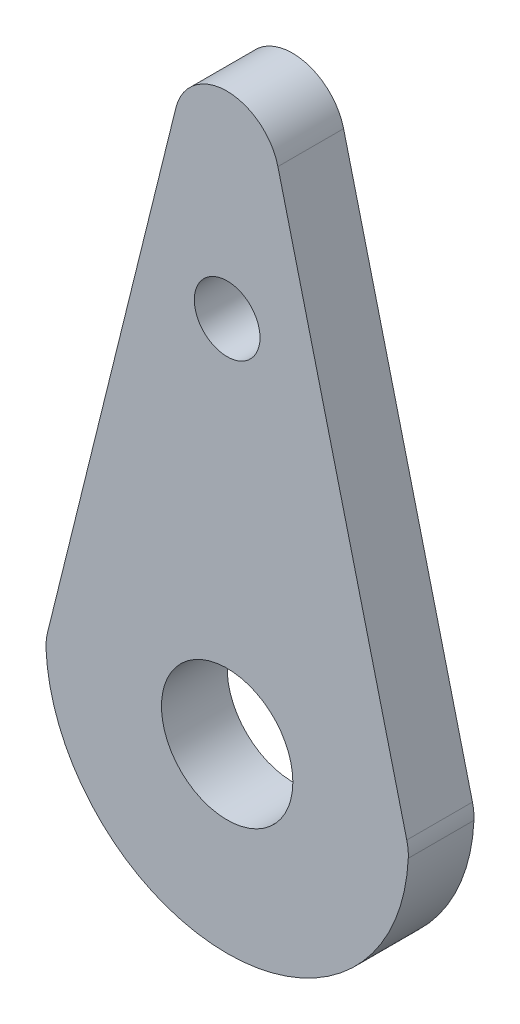
ISO-10303-21;
HEADER;
FILE_DESCRIPTION(('STEP AP214'),'2;1');
FILE_NAME('part.step','',(''),(''),'','','');
FILE_SCHEMA(('AUTOMOTIVE_DESIGN { 1 0 10303 214 1 1 1 1 }'));
ENDSEC;
DATA;
#1=APPLICATION_CONTEXT('core data for automotive mechanical design processes');
#2=APPLICATION_PROTOCOL_DEFINITION('international standard','automotive_design',2000,#1);
#3=PRODUCT_CONTEXT('',#1,'mechanical');
#4=PRODUCT('Part','Part','',(#3));
#5=PRODUCT_RELATED_PRODUCT_CATEGORY('part','',(#4));
#6=PRODUCT_DEFINITION_FORMATION('','',#4);
#7=PRODUCT_DEFINITION_CONTEXT('part definition',#1,'design');
#8=PRODUCT_DEFINITION('design','',#6,#7);
#9=PRODUCT_DEFINITION_SHAPE('','',#8);
#10=(LENGTH_UNIT() NAMED_UNIT(*) SI_UNIT(.MILLI.,.METRE.));
#11=(NAMED_UNIT(*) PLANE_ANGLE_UNIT() SI_UNIT($,.RADIAN.));
#12=(NAMED_UNIT(*) SI_UNIT($,.STERADIAN.) SOLID_ANGLE_UNIT());
#13=UNCERTAINTY_MEASURE_WITH_UNIT(LENGTH_MEASURE(1.E-05),#10,'distance_accuracy_value','');
#14=(GEOMETRIC_REPRESENTATION_CONTEXT(3) GLOBAL_UNCERTAINTY_ASSIGNED_CONTEXT((#13)) GLOBAL_UNIT_ASSIGNED_CONTEXT((#10,
#11,#12)) REPRESENTATION_CONTEXT('',''));
#15=CARTESIAN_POINT('',(0.,0.,0.));
#16=DIRECTION('',(0.,0.,1.));
#17=DIRECTION('',(1.,0.,0.));
#18=AXIS2_PLACEMENT_3D('',#15,#16,#17);
#19=CARTESIAN_POINT('',(-6.21653958344384,-0.283486520800967,0.));
#20=DIRECTION('',(0.,0.,-1.));
#21=DIRECTION('',(-1.,0.,0.));
#22=AXIS2_PLACEMENT_3D('',#19,#20,#21);
#23=PLANE('',#22);
#24=CARTESIAN_POINT('',(0.,0.,0.));
#25=DIRECTION('',(0.,0.,1.));
#26=DIRECTION('',(1.,0.,0.));
#27=AXIS2_PLACEMENT_3D('',#24,#25,#26);
#28=CIRCLE('',#27,3.175);
#29=CARTESIAN_POINT('',(3.175,0.,0.));
#30=VERTEX_POINT('',#29);
#31=EDGE_CURVE('E176',#30,#30,#28,.T.);
#32=ORIENTED_EDGE('',*,*,#31,.T.);
#33=EDGE_LOOP('',(#32));
#34=FACE_BOUND('',#33,.T.);
#35=CARTESIAN_POINT('',(-6.21653958344384,-0.283486520800967,0.));
#36=DIRECTION('',(0.,0.,1.));
#37=DIRECTION('',(-1.,0.,0.));
#38=AXIS2_PLACEMENT_3D('',#35,#36,#37);
#39=CIRCLE('',#38,2.54);
#40=CARTESIAN_POINT('',(-8.68217303065015,0.326637814082969,0.));
#41=VERTEX_POINT('',#40);
#42=CARTESIAN_POINT('',(-8.75390267872705,-0.39919530480136,0.));
#43=VERTEX_POINT('',#42);
#44=EDGE_CURVE('E118',#41,#43,#39,.T.);
#45=ORIENTED_EDGE('',*,*,#44,.F.);
#46=DIRECTION('',(-0.240206431056668,-0.970721829608781,0.));
#47=VECTOR('',#46,1.);
#48=CARTESIAN_POINT('',(-8.68217303065015,0.326637814082969,0.));
#49=LINE('',#48,#47);
#50=CARTESIAN_POINT('',(-2.47773560937815,25.4,0.));
#51=VERTEX_POINT('',#50);
#52=EDGE_CURVE('E78',#51,#41,#49,.T.);
#53=ORIENTED_EDGE('',*,*,#52,.F.);
#54=CARTESIAN_POINT('',(-0.0121021621718495,24.7898756651161,0.));
#55=DIRECTION('',(0.,0.,1.));
#56=DIRECTION('',(1.,0.,0.));
#57=AXIS2_PLACEMENT_3D('',#54,#55,#56);
#58=CIRCLE('',#57,2.54);
#59=CARTESIAN_POINT('',(2.45298258036129,25.4022131636659,0.));
#60=VERTEX_POINT('',#59);
#61=EDGE_CURVE('E72',#60,#51,#58,.T.);
#62=ORIENTED_EDGE('',*,*,#61,.F.);
#63=DIRECTION('',(-0.241077755334594,0.970505804146907,0.));
#64=VECTOR('',#63,1.);
#65=CARTESIAN_POINT('',(2.45298258036129,25.4022131636659,0.));
#66=LINE('',#65,#64);
#67=CARTESIAN_POINT('',(8.68157580931668,0.327789055221806,0.));
#68=VERTEX_POINT('',#67);
#69=EDGE_CURVE('E108',#68,#60,#66,.T.);
#70=ORIENTED_EDGE('',*,*,#69,.F.);
#71=CARTESIAN_POINT('',(6.21649106678354,-0.284548443328062,0.));
#72=DIRECTION('',(0.,0.,1.));
#73=DIRECTION('',(1.,0.,0.));
#74=AXIS2_PLACEMENT_3D('',#71,#72,#73);
#75=CIRCLE('',#74,2.54);
#76=CARTESIAN_POINT('',(8.75383435934825,-0.400690665094618,0.));
#77=VERTEX_POINT('',#76);
#78=EDGE_CURVE('E124',#77,#68,#75,.T.);
#79=ORIENTED_EDGE('',*,*,#78,.F.);
#80=CARTESIAN_POINT('',(0.,0.,0.));
#81=DIRECTION('',(0.,0.,1.));
#82=DIRECTION('',(1.,0.,0.));
#83=AXIS2_PLACEMENT_3D('',#80,#81,#82);
#84=CIRCLE('',#83,8.763);
#85=EDGE_CURVE('E121',#43,#77,#84,.T.);
#86=ORIENTED_EDGE('',*,*,#85,.F.);
#87=EDGE_LOOP('',(#45,#53,#62,#70,#79,#86));
#88=FACE_BOUND('',#87,.T.);
#89=CARTESIAN_POINT('',(0.,17.8048754092514,0.));
#90=DIRECTION('',(0.,0.,-1.));
#91=DIRECTION('',(-1.,0.,0.));
#92=AXIS2_PLACEMENT_3D('',#89,#90,#91);
#93=CIRCLE('',#92,1.5875);
#94=CARTESIAN_POINT('',(-1.5875,17.8048754092514,0.));
#95=VERTEX_POINT('',#94);
#96=EDGE_CURVE('E171',#95,#95,#93,.F.);
#97=ORIENTED_EDGE('',*,*,#96,.T.);
#98=EDGE_LOOP('',(#97));
#99=FACE_BOUND('',#98,.T.);
#100=ADVANCED_FACE('F32',(#34,#88,#99),#23,.T.);
#101=CARTESIAN_POINT('',(-6.21653958344384,-0.283486520800967,3.175));
#102=DIRECTION('',(0.,0.,-1.));
#103=DIRECTION('',(-1.,0.,0.));
#104=AXIS2_PLACEMENT_3D('',#101,#102,#103);
#105=PLANE('',#104);
#106=CARTESIAN_POINT('',(0.,17.8048754092514,3.175));
#107=DIRECTION('',(0.,0.,1.));
#108=DIRECTION('',(1.,0.,0.));
#109=AXIS2_PLACEMENT_3D('',#106,#107,#108);
#110=CIRCLE('',#109,1.5875);
#111=CARTESIAN_POINT('',(1.5875,17.8048754092514,3.175));
#112=VERTEX_POINT('',#111);
#113=EDGE_CURVE('E174',#112,#112,#110,.T.);
#114=ORIENTED_EDGE('',*,*,#113,.F.);
#115=EDGE_LOOP('',(#114));
#116=FACE_BOUND('',#115,.T.);
#117=CARTESIAN_POINT('',(-6.21653958344384,-0.283486520800967,3.175));
#118=DIRECTION('',(0.,0.,1.));
#119=DIRECTION('',(-1.,0.,0.));
#120=AXIS2_PLACEMENT_3D('',#117,#118,#119);
#121=CIRCLE('',#120,2.54);
#122=CARTESIAN_POINT('',(-8.68217303065015,0.326637814082969,3.175));
#123=VERTEX_POINT('',#122);
#124=CARTESIAN_POINT('',(-8.75390267872705,-0.39919530480136,3.175));
#125=VERTEX_POINT('',#124);
#126=EDGE_CURVE('E129',#123,#125,#121,.T.);
#127=ORIENTED_EDGE('',*,*,#126,.T.);
#128=CARTESIAN_POINT('',(0.,0.,3.175));
#129=DIRECTION('',(0.,0.,1.));
#130=DIRECTION('',(1.,0.,0.));
#131=AXIS2_PLACEMENT_3D('',#128,#129,#130);
#132=CIRCLE('',#131,8.763);
#133=CARTESIAN_POINT('',(8.75383435934825,-0.400690665094618,3.175));
#134=VERTEX_POINT('',#133);
#135=EDGE_CURVE('E86',#125,#134,#132,.T.);
#136=ORIENTED_EDGE('',*,*,#135,.T.);
#137=CARTESIAN_POINT('',(6.21649106678354,-0.284548443328062,3.175));
#138=DIRECTION('',(0.,0.,1.));
#139=DIRECTION('',(1.,0.,0.));
#140=AXIS2_PLACEMENT_3D('',#137,#138,#139);
#141=CIRCLE('',#140,2.54);
#142=CARTESIAN_POINT('',(8.68157580931668,0.327789055221806,3.175));
#143=VERTEX_POINT('',#142);
#144=EDGE_CURVE('E100',#134,#143,#141,.T.);
#145=ORIENTED_EDGE('',*,*,#144,.T.);
#146=DIRECTION('',(-0.241077755334594,0.970505804146907,0.));
#147=VECTOR('',#146,1.);
#148=CARTESIAN_POINT('',(2.45298258036129,25.4022131636659,3.175));
#149=LINE('',#148,#147);
#150=CARTESIAN_POINT('',(2.45298258036129,25.4022131636659,3.175));
#151=VERTEX_POINT('',#150);
#152=EDGE_CURVE('E93',#143,#151,#149,.T.);
#153=ORIENTED_EDGE('',*,*,#152,.T.);
#154=CARTESIAN_POINT('',(-0.0121021621718495,24.7898756651161,3.175));
#155=DIRECTION('',(0.,0.,1.));
#156=DIRECTION('',(1.,0.,0.));
#157=AXIS2_PLACEMENT_3D('',#154,#155,#156);
#158=CIRCLE('',#157,2.54);
#159=CARTESIAN_POINT('',(-2.47773560937815,25.4,3.175));
#160=VERTEX_POINT('',#159);
#161=EDGE_CURVE('E98',#151,#160,#158,.T.);
#162=ORIENTED_EDGE('',*,*,#161,.T.);
#163=DIRECTION('',(-0.240206431056668,-0.970721829608781,0.));
#164=VECTOR('',#163,1.);
#165=CARTESIAN_POINT('',(-8.68217303065015,0.326637814082969,3.175));
#166=LINE('',#165,#164);
#167=EDGE_CURVE('E49',#160,#123,#166,.T.);
#168=ORIENTED_EDGE('',*,*,#167,.T.);
#169=EDGE_LOOP('',(#127,#136,#145,#153,#162,#168));
#170=FACE_BOUND('',#169,.T.);
#171=CARTESIAN_POINT('',(0.,0.,3.175));
#172=DIRECTION('',(0.,0.,1.));
#173=DIRECTION('',(1.,0.,0.));
#174=AXIS2_PLACEMENT_3D('',#171,#172,#173);
#175=CIRCLE('',#174,3.175);
#176=CARTESIAN_POINT('',(3.175,0.,3.175));
#177=VERTEX_POINT('',#176);
#178=EDGE_CURVE('E122',#177,#177,#175,.T.);
#179=ORIENTED_EDGE('',*,*,#178,.F.);
#180=EDGE_LOOP('',(#179));
#181=FACE_BOUND('',#180,.T.);
#182=ADVANCED_FACE('F95',(#116,#170,#181),#105,.F.);
#183=CARTESIAN_POINT('',(-6.21653958344384,-0.283486520800967,3.175));
#184=DIRECTION('',(0.,0.,-1.));
#185=DIRECTION('',(-1.,0.,0.));
#186=AXIS2_PLACEMENT_3D('',#183,#184,#185);
#187=CYLINDRICAL_SURFACE('',#186,2.54);
#188=ORIENTED_EDGE('',*,*,#44,.T.);
#189=DIRECTION('',(0.,0.,-1.));
#190=VECTOR('',#189,1.);
#191=CARTESIAN_POINT('',(-8.75390267872705,-0.39919530480136,3.175));
#192=LINE('',#191,#190);
#193=EDGE_CURVE('E11',#125,#43,#192,.T.);
#194=ORIENTED_EDGE('',*,*,#193,.F.);
#195=ORIENTED_EDGE('',*,*,#126,.F.);
#196=DIRECTION('',(0.,0.,-1.));
#197=VECTOR('',#196,1.);
#198=CARTESIAN_POINT('',(-8.68217303065015,0.326637814082969,3.175));
#199=LINE('',#198,#197);
#200=EDGE_CURVE('E114',#123,#41,#199,.T.);
#201=ORIENTED_EDGE('',*,*,#200,.T.);
#202=EDGE_LOOP('',(#188,#194,#195,#201));
#203=FACE_BOUND('',#202,.T.);
#204=ADVANCED_FACE('F34',(#203),#187,.T.);
#205=CARTESIAN_POINT('',(0.,0.,3.175));
#206=DIRECTION('',(0.,0.,-1.));
#207=DIRECTION('',(-1.,0.,0.));
#208=AXIS2_PLACEMENT_3D('',#205,#206,#207);
#209=CYLINDRICAL_SURFACE('',#208,8.763);
#210=ORIENTED_EDGE('',*,*,#85,.T.);
#211=DIRECTION('',(0.,0.,-1.));
#212=VECTOR('',#211,1.);
#213=CARTESIAN_POINT('',(8.75383435934825,-0.400690665094618,3.175));
#214=LINE('',#213,#212);
#215=EDGE_CURVE('E41',#134,#77,#214,.T.);
#216=ORIENTED_EDGE('',*,*,#215,.F.);
#217=ORIENTED_EDGE('',*,*,#135,.F.);
#218=ORIENTED_EDGE('',*,*,#193,.T.);
#219=EDGE_LOOP('',(#210,#216,#217,#218));
#220=FACE_BOUND('',#219,.T.);
#221=ADVANCED_FACE('F212',(#220),#209,.T.);
#222=CARTESIAN_POINT('',(6.21649106678354,-0.284548443328062,3.175));
#223=DIRECTION('',(0.,0.,-1.));
#224=DIRECTION('',(-1.,0.,0.));
#225=AXIS2_PLACEMENT_3D('',#222,#223,#224);
#226=CYLINDRICAL_SURFACE('',#225,2.54);
#227=ORIENTED_EDGE('',*,*,#78,.T.);
#228=DIRECTION('',(0.,0.,-1.));
#229=VECTOR('',#228,1.);
#230=CARTESIAN_POINT('',(8.68157580931668,0.327789055221806,3.175));
#231=LINE('',#230,#229);
#232=EDGE_CURVE('E109',#143,#68,#231,.T.);
#233=ORIENTED_EDGE('',*,*,#232,.F.);
#234=ORIENTED_EDGE('',*,*,#144,.F.);
#235=ORIENTED_EDGE('',*,*,#215,.T.);
#236=EDGE_LOOP('',(#227,#233,#234,#235));
#237=FACE_BOUND('',#236,.T.);
#238=ADVANCED_FACE('F135',(#237),#226,.T.);
#239=CARTESIAN_POINT('',(2.45298258036129,25.4022131636659,3.175));
#240=DIRECTION('',(-0.970505804146907,-0.241077755334594,0.));
#241=DIRECTION('',(0.241077755334594,-0.970505804146907,0.));
#242=AXIS2_PLACEMENT_3D('',#239,#240,#241);
#243=PLANE('',#242);
#244=ORIENTED_EDGE('',*,*,#69,.T.);
#245=DIRECTION('',(0.,0.,-1.));
#246=VECTOR('',#245,1.);
#247=CARTESIAN_POINT('',(2.45298258036129,25.4022131636659,3.175));
#248=LINE('',#247,#246);
#249=EDGE_CURVE('E105',#151,#60,#248,.T.);
#250=ORIENTED_EDGE('',*,*,#249,.F.);
#251=ORIENTED_EDGE('',*,*,#152,.F.);
#252=ORIENTED_EDGE('',*,*,#232,.T.);
#253=EDGE_LOOP('',(#244,#250,#251,#252));
#254=FACE_BOUND('',#253,.T.);
#255=ADVANCED_FACE('F106',(#254),#243,.F.);
#256=CARTESIAN_POINT('',(-0.0121021621718495,24.7898756651161,3.175));
#257=DIRECTION('',(0.,0.,-1.));
#258=DIRECTION('',(-1.,0.,0.));
#259=AXIS2_PLACEMENT_3D('',#256,#257,#258);
#260=CYLINDRICAL_SURFACE('',#259,2.54);
#261=ORIENTED_EDGE('',*,*,#61,.T.);
#262=DIRECTION('',(0.,0.,-1.));
#263=VECTOR('',#262,1.);
#264=CARTESIAN_POINT('',(-2.47773560937815,25.4,3.175));
#265=LINE('',#264,#263);
#266=EDGE_CURVE('E110',#160,#51,#265,.T.);
#267=ORIENTED_EDGE('',*,*,#266,.F.);
#268=ORIENTED_EDGE('',*,*,#161,.F.);
#269=ORIENTED_EDGE('',*,*,#249,.T.);
#270=EDGE_LOOP('',(#261,#267,#268,#269));
#271=FACE_BOUND('',#270,.T.);
#272=ADVANCED_FACE('F112',(#271),#260,.T.);
#273=CARTESIAN_POINT('',(-8.68217303065015,0.326637814082969,3.175));
#274=DIRECTION('',(0.970721829608781,-0.240206431056668,0.));
#275=DIRECTION('',(0.240206431056668,0.970721829608781,0.));
#276=AXIS2_PLACEMENT_3D('',#273,#274,#275);
#277=PLANE('',#276);
#278=ORIENTED_EDGE('',*,*,#52,.T.);
#279=ORIENTED_EDGE('',*,*,#200,.F.);
#280=ORIENTED_EDGE('',*,*,#167,.F.);
#281=ORIENTED_EDGE('',*,*,#266,.T.);
#282=EDGE_LOOP('',(#278,#279,#280,#281));
#283=FACE_BOUND('',#282,.T.);
#284=ADVANCED_FACE('F142',(#283),#277,.F.);
#285=CARTESIAN_POINT('',(0.,0.,3.175));
#286=DIRECTION('',(0.,0.,-1.));
#287=DIRECTION('',(-1.,0.,0.));
#288=AXIS2_PLACEMENT_3D('',#285,#286,#287);
#289=CYLINDRICAL_SURFACE('',#288,3.175);
#290=ORIENTED_EDGE('',*,*,#178,.T.);
#291=EDGE_LOOP('',(#290));
#292=FACE_BOUND('',#291,.T.);
#293=ORIENTED_EDGE('',*,*,#31,.F.);
#294=EDGE_LOOP('',(#293));
#295=FACE_BOUND('',#294,.T.);
#296=ADVANCED_FACE('F144',(#292,#295),#289,.F.);
#297=CARTESIAN_POINT('',(0.,17.8048754092514,3.175));
#298=DIRECTION('',(0.,0.,1.));
#299=DIRECTION('',(1.,0.,0.));
#300=AXIS2_PLACEMENT_3D('',#297,#298,#299);
#301=CYLINDRICAL_SURFACE('',#300,1.5875);
#302=ORIENTED_EDGE('',*,*,#96,.F.);
#303=EDGE_LOOP('',(#302));
#304=FACE_BOUND('',#303,.T.);
#305=ORIENTED_EDGE('',*,*,#113,.T.);
#306=EDGE_LOOP('',(#305));
#307=FACE_BOUND('',#306,.T.);
#308=ADVANCED_FACE('F150',(#304,#307),#301,.F.);
#309=CLOSED_SHELL('',(#100,#182,#204,#221,#238,#255,#272,#284,#296,#308));
#310=MANIFOLD_SOLID_BREP('B2',#309);
#311=ADVANCED_BREP_SHAPE_REPRESENTATION('',(#18,#310),#14);
#312=SHAPE_DEFINITION_REPRESENTATION(#9,#311);
ENDSEC;
END-ISO-10303-21;
